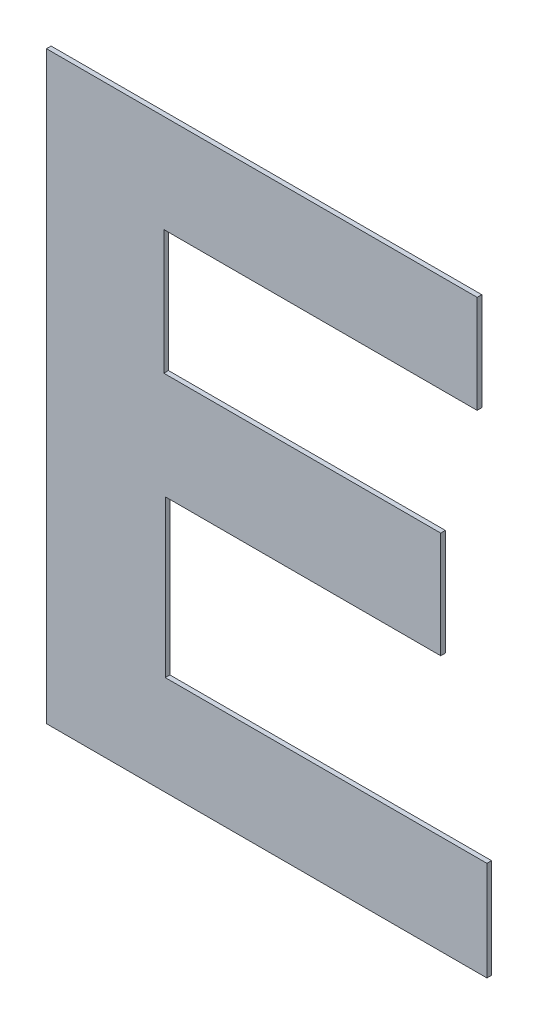
ISO-10303-21;
HEADER;
FILE_DESCRIPTION(('STEP AP214'),'2;1');
FILE_NAME('part.step','',(''),(''),'','','');
FILE_SCHEMA(('AUTOMOTIVE_DESIGN { 1 0 10303 214 1 1 1 1 }'));
ENDSEC;
DATA;
#1=APPLICATION_CONTEXT('core data for automotive mechanical design processes');
#2=APPLICATION_PROTOCOL_DEFINITION('international standard','automotive_design',2000,#1);
#3=PRODUCT_CONTEXT('',#1,'mechanical');
#4=PRODUCT('Part','Part','',(#3));
#5=PRODUCT_RELATED_PRODUCT_CATEGORY('part','',(#4));
#6=PRODUCT_DEFINITION_FORMATION('','',#4);
#7=PRODUCT_DEFINITION_CONTEXT('part definition',#1,'design');
#8=PRODUCT_DEFINITION('design','',#6,#7);
#9=PRODUCT_DEFINITION_SHAPE('','',#8);
#10=(LENGTH_UNIT() NAMED_UNIT(*) SI_UNIT(.MILLI.,.METRE.));
#11=(NAMED_UNIT(*) PLANE_ANGLE_UNIT() SI_UNIT($,.RADIAN.));
#12=(NAMED_UNIT(*) SI_UNIT($,.STERADIAN.) SOLID_ANGLE_UNIT());
#13=UNCERTAINTY_MEASURE_WITH_UNIT(LENGTH_MEASURE(1.E-05),#10,'distance_accuracy_value','');
#14=(GEOMETRIC_REPRESENTATION_CONTEXT(3) GLOBAL_UNCERTAINTY_ASSIGNED_CONTEXT((#13)) GLOBAL_UNIT_ASSIGNED_CONTEXT((#10,
#11,#12)) REPRESENTATION_CONTEXT('',''));
#15=CARTESIAN_POINT('',(0.,0.,0.));
#16=DIRECTION('',(0.,0.,1.));
#17=DIRECTION('',(1.,0.,0.));
#18=AXIS2_PLACEMENT_3D('',#15,#16,#17);
#19=CARTESIAN_POINT('',(-0.7002789706921,-0.078781583834882,0.00086146168299));
#20=DIRECTION('',(-1.,0.,0.));
#21=DIRECTION('',(0.,0.,1.));
#22=AXIS2_PLACEMENT_3D('',#19,#20,#21);
#23=PLANE('',#22);
#24=DIRECTION('',(0.,0.,1.));
#25=VECTOR('',#24,1.);
#26=CARTESIAN_POINT('',(-0.7002789706921,-0.1544312260326,-0.00033853831701));
#27=LINE('',#26,#25);
#28=CARTESIAN_POINT('',(-0.7002789706921,-0.1544312260326,-0.00033853831701));
#29=VERTEX_POINT('',#28);
#30=CARTESIAN_POINT('',(-0.7002789706921,-0.1544312260326,0.00086146168299));
#31=VERTEX_POINT('',#30);
#32=EDGE_CURVE('E11',#29,#31,#27,.T.);
#33=ORIENTED_EDGE('',*,*,#32,.T.);
#34=DIRECTION('',(0.,1.,0.));
#35=VECTOR('',#34,1.);
#36=CARTESIAN_POINT('',(-0.7002789706921,-0.1544312260326,0.00086146168299));
#37=LINE('',#36,#35);
#38=CARTESIAN_POINT('',(-0.7002789706921,-0.00313194163716401,0.00086146168299));
#39=VERTEX_POINT('',#38);
#40=EDGE_CURVE('E24',#31,#39,#37,.T.);
#41=ORIENTED_EDGE('',*,*,#40,.T.);
#42=DIRECTION('',(0.,0.,1.));
#43=VECTOR('',#42,1.);
#44=CARTESIAN_POINT('',(-0.7002789706921,-0.00313194163716401,-0.00033853831701));
#45=LINE('',#44,#43);
#46=CARTESIAN_POINT('',(-0.7002789706921,-0.00313194163716401,-0.00033853831701));
#47=VERTEX_POINT('',#46);
#48=EDGE_CURVE('E197',#47,#39,#45,.T.);
#49=ORIENTED_EDGE('',*,*,#48,.F.);
#50=DIRECTION('',(0.,1.,0.));
#51=VECTOR('',#50,1.);
#52=CARTESIAN_POINT('',(-0.7002789706921,-0.1544312260326,-0.00033853831701));
#53=LINE('',#52,#51);
#54=EDGE_CURVE('E195',#29,#47,#53,.T.);
#55=ORIENTED_EDGE('',*,*,#54,.F.);
#56=EDGE_LOOP('',(#33,#41,#49,#55));
#57=FACE_BOUND('',#56,.T.);
#58=ADVANCED_FACE('F17',(#57),#23,.T.);
#59=CARTESIAN_POINT('',(-0.6445458179521,-0.00313194163716401,0.00086146168299));
#60=DIRECTION('',(0.,1.,0.));
#61=DIRECTION('',(0.,0.,1.));
#62=AXIS2_PLACEMENT_3D('',#59,#60,#61);
#63=PLANE('',#62);
#64=ORIENTED_EDGE('',*,*,#48,.T.);
#65=DIRECTION('',(1.,0.,0.));
#66=VECTOR('',#65,1.);
#67=CARTESIAN_POINT('',(-0.7002789706921,-0.00313194163716401,0.00086146168299));
#68=LINE('',#67,#66);
#69=CARTESIAN_POINT('',(-0.5888126652121,-0.00313194163716401,0.00086146168299));
#70=VERTEX_POINT('',#69);
#71=EDGE_CURVE('E193',#39,#70,#68,.T.);
#72=ORIENTED_EDGE('',*,*,#71,.T.);
#73=DIRECTION('',(0.,0.,1.));
#74=VECTOR('',#73,1.);
#75=CARTESIAN_POINT('',(-0.5888126652121,-0.00313194163716401,-0.00033853831701));
#76=LINE('',#75,#74);
#77=CARTESIAN_POINT('',(-0.5888126652121,-0.00313194163716401,-0.00033853831701));
#78=VERTEX_POINT('',#77);
#79=EDGE_CURVE('E190',#78,#70,#76,.T.);
#80=ORIENTED_EDGE('',*,*,#79,.F.);
#81=DIRECTION('',(1.,0.,0.));
#82=VECTOR('',#81,1.);
#83=CARTESIAN_POINT('',(-0.7002789706921,-0.00313194163716401,-0.00033853831701));
#84=LINE('',#83,#82);
#85=EDGE_CURVE('E187',#47,#78,#84,.T.);
#86=ORIENTED_EDGE('',*,*,#85,.F.);
#87=EDGE_LOOP('',(#64,#72,#80,#86));
#88=FACE_BOUND('',#87,.T.);
#89=ADVANCED_FACE('F203',(#88),#63,.T.);
#90=CARTESIAN_POINT('',(-0.5888126652121,-0.015802228964852,0.00086146168299));
#91=DIRECTION('',(1.,0.,0.));
#92=DIRECTION('',(0.,0.,-1.));
#93=AXIS2_PLACEMENT_3D('',#90,#91,#92);
#94=PLANE('',#93);
#95=ORIENTED_EDGE('',*,*,#79,.T.);
#96=DIRECTION('',(0.,-1.,0.));
#97=VECTOR('',#96,1.);
#98=CARTESIAN_POINT('',(-0.5888126652121,-0.00313194163716401,0.00086146168299));
#99=LINE('',#98,#97);
#100=CARTESIAN_POINT('',(-0.5888126652121,-0.02847251629254,0.00086146168299));
#101=VERTEX_POINT('',#100);
#102=EDGE_CURVE('E185',#70,#101,#99,.T.);
#103=ORIENTED_EDGE('',*,*,#102,.T.);
#104=DIRECTION('',(0.,0.,1.));
#105=VECTOR('',#104,1.);
#106=CARTESIAN_POINT('',(-0.5888126652121,-0.02847251629254,-0.00033853831701));
#107=LINE('',#106,#105);
#108=CARTESIAN_POINT('',(-0.5888126652121,-0.02847251629254,-0.00033853831701));
#109=VERTEX_POINT('',#108);
#110=EDGE_CURVE('E182',#109,#101,#107,.T.);
#111=ORIENTED_EDGE('',*,*,#110,.F.);
#112=DIRECTION('',(0.,-1.,0.));
#113=VECTOR('',#112,1.);
#114=CARTESIAN_POINT('',(-0.5888126652121,-0.00313194163716401,-0.00033853831701));
#115=LINE('',#114,#113);
#116=EDGE_CURVE('E179',#78,#109,#115,.T.);
#117=ORIENTED_EDGE('',*,*,#116,.F.);
#118=EDGE_LOOP('',(#95,#103,#111,#117));
#119=FACE_BOUND('',#118,.T.);
#120=ADVANCED_FACE('F209',(#119),#94,.T.);
#121=CARTESIAN_POINT('',(-0.629355128198574,-0.02847251629254,0.00086146168299));
#122=DIRECTION('',(0.,-1.,0.));
#123=DIRECTION('',(0.,0.,-1.));
#124=AXIS2_PLACEMENT_3D('',#121,#122,#123);
#125=PLANE('',#124);
#126=ORIENTED_EDGE('',*,*,#110,.T.);
#127=DIRECTION('',(-1.,0.,0.));
#128=VECTOR('',#127,1.);
#129=CARTESIAN_POINT('',(-0.5888126652121,-0.02847251629254,0.00086146168299));
#130=LINE('',#129,#128);
#131=CARTESIAN_POINT('',(-0.669897591185048,-0.02847251629254,0.00086146168299));
#132=VERTEX_POINT('',#131);
#133=EDGE_CURVE('E177',#101,#132,#130,.T.);
#134=ORIENTED_EDGE('',*,*,#133,.T.);
#135=DIRECTION('',(0.,0.,1.));
#136=VECTOR('',#135,1.);
#137=CARTESIAN_POINT('',(-0.669897591185048,-0.02847251629254,-0.00033853831701));
#138=LINE('',#137,#136);
#139=CARTESIAN_POINT('',(-0.669897591185048,-0.02847251629254,-0.00033853831701));
#140=VERTEX_POINT('',#139);
#141=EDGE_CURVE('E174',#140,#132,#138,.T.);
#142=ORIENTED_EDGE('',*,*,#141,.F.);
#143=DIRECTION('',(-1.,0.,0.));
#144=VECTOR('',#143,1.);
#145=CARTESIAN_POINT('',(-0.5888126652121,-0.02847251629254,-0.00033853831701));
#146=LINE('',#145,#144);
#147=EDGE_CURVE('E171',#109,#140,#146,.T.);
#148=ORIENTED_EDGE('',*,*,#147,.F.);
#149=EDGE_LOOP('',(#126,#134,#142,#148));
#150=FACE_BOUND('',#149,.T.);
#151=ADVANCED_FACE('F213',(#150),#125,.T.);
#152=CARTESIAN_POINT('',(-0.669897591185048,-0.04457751571217,0.00086146168299));
#153=DIRECTION('',(1.,0.,0.));
#154=DIRECTION('',(0.,0.,-1.));
#155=AXIS2_PLACEMENT_3D('',#152,#153,#154);
#156=PLANE('',#155);
#157=ORIENTED_EDGE('',*,*,#141,.T.);
#158=DIRECTION('',(0.,-1.,0.));
#159=VECTOR('',#158,1.);
#160=CARTESIAN_POINT('',(-0.669897591185048,-0.02847251629254,0.00086146168299));
#161=LINE('',#160,#159);
#162=CARTESIAN_POINT('',(-0.669897591185048,-0.0606825151318,0.00086146168299));
#163=VERTEX_POINT('',#162);
#164=EDGE_CURVE('E169',#132,#163,#161,.T.);
#165=ORIENTED_EDGE('',*,*,#164,.T.);
#166=DIRECTION('',(0.,0.,1.));
#167=VECTOR('',#166,1.);
#168=CARTESIAN_POINT('',(-0.669897591185048,-0.0606825151318,-0.00033853831701));
#169=LINE('',#168,#167);
#170=CARTESIAN_POINT('',(-0.669897591185048,-0.0606825151318,-0.00033853831701));
#171=VERTEX_POINT('',#170);
#172=EDGE_CURVE('E166',#171,#163,#169,.T.);
#173=ORIENTED_EDGE('',*,*,#172,.F.);
#174=DIRECTION('',(0.,-1.,0.));
#175=VECTOR('',#174,1.);
#176=CARTESIAN_POINT('',(-0.669897591185048,-0.02847251629254,-0.00033853831701));
#177=LINE('',#176,#175);
#178=EDGE_CURVE('E163',#140,#171,#177,.T.);
#179=ORIENTED_EDGE('',*,*,#178,.F.);
#180=EDGE_LOOP('',(#157,#165,#173,#179));
#181=FACE_BOUND('',#180,.T.);
#182=ADVANCED_FACE('F217',(#181),#156,.T.);
#183=CARTESIAN_POINT('',(-0.634066839369706,-0.0606825151318,0.00086146168299));
#184=DIRECTION('',(0.,1.,0.));
#185=DIRECTION('',(0.,0.,1.));
#186=AXIS2_PLACEMENT_3D('',#183,#184,#185);
#187=PLANE('',#186);
#188=ORIENTED_EDGE('',*,*,#172,.T.);
#189=DIRECTION('',(1.,0.,0.));
#190=VECTOR('',#189,1.);
#191=CARTESIAN_POINT('',(-0.669897591185048,-0.0606825151318,0.00086146168299));
#192=LINE('',#191,#190);
#193=CARTESIAN_POINT('',(-0.598236087554364,-0.0606825151318,0.00086146168299));
#194=VERTEX_POINT('',#193);
#195=EDGE_CURVE('E161',#163,#194,#192,.T.);
#196=ORIENTED_EDGE('',*,*,#195,.T.);
#197=DIRECTION('',(0.,0.,1.));
#198=VECTOR('',#197,1.);
#199=CARTESIAN_POINT('',(-0.598236087554364,-0.0606825151318,-0.00033853831701));
#200=LINE('',#199,#198);
#201=CARTESIAN_POINT('',(-0.598236087554364,-0.0606825151318,-0.00033853831701));
#202=VERTEX_POINT('',#201);
#203=EDGE_CURVE('E158',#202,#194,#200,.T.);
#204=ORIENTED_EDGE('',*,*,#203,.F.);
#205=DIRECTION('',(1.,0.,0.));
#206=VECTOR('',#205,1.);
#207=CARTESIAN_POINT('',(-0.669897591185048,-0.0606825151318,-0.00033853831701));
#208=LINE('',#207,#206);
#209=EDGE_CURVE('E155',#171,#202,#208,.T.);
#210=ORIENTED_EDGE('',*,*,#209,.F.);
#211=EDGE_LOOP('',(#188,#196,#204,#210));
#212=FACE_BOUND('',#211,.T.);
#213=ADVANCED_FACE('F220',(#212),#187,.T.);
#214=CARTESIAN_POINT('',(-0.598236087554364,-0.0744368970102,0.00086146168299));
#215=DIRECTION('',(1.,0.,0.));
#216=DIRECTION('',(0.,0.,-1.));
#217=AXIS2_PLACEMENT_3D('',#214,#215,#216);
#218=PLANE('',#217);
#219=ORIENTED_EDGE('',*,*,#203,.T.);
#220=DIRECTION('',(0.,-1.,0.));
#221=VECTOR('',#220,1.);
#222=CARTESIAN_POINT('',(-0.598236087554364,-0.0606825151318,0.00086146168299));
#223=LINE('',#222,#221);
#224=CARTESIAN_POINT('',(-0.598236087554364,-0.0881912788886,0.00086146168299));
#225=VERTEX_POINT('',#224);
#226=EDGE_CURVE('E153',#194,#225,#223,.T.);
#227=ORIENTED_EDGE('',*,*,#226,.T.);
#228=DIRECTION('',(0.,0.,1.));
#229=VECTOR('',#228,1.);
#230=CARTESIAN_POINT('',(-0.598236087554364,-0.0881912788886,-0.00033853831701));
#231=LINE('',#230,#229);
#232=CARTESIAN_POINT('',(-0.598236087554364,-0.0881912788886,-0.00033853831701));
#233=VERTEX_POINT('',#232);
#234=EDGE_CURVE('E150',#233,#225,#231,.T.);
#235=ORIENTED_EDGE('',*,*,#234,.F.);
#236=DIRECTION('',(0.,-1.,0.));
#237=VECTOR('',#236,1.);
#238=CARTESIAN_POINT('',(-0.598236087554364,-0.0606825151318,-0.00033853831701));
#239=LINE('',#238,#237);
#240=EDGE_CURVE('E147',#202,#233,#239,.T.);
#241=ORIENTED_EDGE('',*,*,#240,.F.);
#242=EDGE_LOOP('',(#219,#227,#235,#241));
#243=FACE_BOUND('',#242,.T.);
#244=ADVANCED_FACE('F225',(#243),#218,.T.);
#245=CARTESIAN_POINT('',(-0.633883327196516,-0.0881912788886,0.00086146168299));
#246=DIRECTION('',(0.,-1.,0.));
#247=DIRECTION('',(0.,0.,-1.));
#248=AXIS2_PLACEMENT_3D('',#245,#246,#247);
#249=PLANE('',#248);
#250=ORIENTED_EDGE('',*,*,#234,.T.);
#251=DIRECTION('',(-1.,0.,0.));
#252=VECTOR('',#251,1.);
#253=CARTESIAN_POINT('',(-0.598236087554364,-0.0881912788886,0.00086146168299));
#254=LINE('',#253,#252);
#255=CARTESIAN_POINT('',(-0.669530566838668,-0.0881912788886,0.00086146168299));
#256=VERTEX_POINT('',#255);
#257=EDGE_CURVE('E145',#225,#256,#254,.T.);
#258=ORIENTED_EDGE('',*,*,#257,.T.);
#259=DIRECTION('',(0.,0.,1.));
#260=VECTOR('',#259,1.);
#261=CARTESIAN_POINT('',(-0.669530566838668,-0.0881912788886,-0.00033853831701));
#262=LINE('',#261,#260);
#263=CARTESIAN_POINT('',(-0.669530566838668,-0.0881912788886,-0.00033853831701));
#264=VERTEX_POINT('',#263);
#265=EDGE_CURVE('E142',#264,#256,#262,.T.);
#266=ORIENTED_EDGE('',*,*,#265,.F.);
#267=DIRECTION('',(-1.,0.,0.));
#268=VECTOR('',#267,1.);
#269=CARTESIAN_POINT('',(-0.598236087554364,-0.0881912788886,-0.00033853831701));
#270=LINE('',#269,#268);
#271=EDGE_CURVE('E139',#233,#264,#270,.T.);
#272=ORIENTED_EDGE('',*,*,#271,.F.);
#273=EDGE_LOOP('',(#250,#258,#266,#272));
#274=FACE_BOUND('',#273,.T.);
#275=ADVANCED_FACE('F229',(#274),#249,.T.);
#276=CARTESIAN_POINT('',(-0.669530566838668,-0.1084588979374,0.00086146168299));
#277=DIRECTION('',(1.,0.,0.));
#278=DIRECTION('',(0.,0.,-1.));
#279=AXIS2_PLACEMENT_3D('',#276,#277,#278);
#280=PLANE('',#279);
#281=ORIENTED_EDGE('',*,*,#265,.T.);
#282=DIRECTION('',(0.,-1.,0.));
#283=VECTOR('',#282,1.);
#284=CARTESIAN_POINT('',(-0.669530566838668,-0.0881912788886,0.00086146168299));
#285=LINE('',#284,#283);
#286=CARTESIAN_POINT('',(-0.669530566838668,-0.1287265169862,0.00086146168299));
#287=VERTEX_POINT('',#286);
#288=EDGE_CURVE('E137',#256,#287,#285,.T.);
#289=ORIENTED_EDGE('',*,*,#288,.T.);
#290=DIRECTION('',(0.,0.,1.));
#291=VECTOR('',#290,1.);
#292=CARTESIAN_POINT('',(-0.669530566838668,-0.1287265169862,-0.00033853831701));
#293=LINE('',#292,#291);
#294=CARTESIAN_POINT('',(-0.669530566838668,-0.1287265169862,-0.00033853831701));
#295=VERTEX_POINT('',#294);
#296=EDGE_CURVE('E134',#295,#287,#293,.T.);
#297=ORIENTED_EDGE('',*,*,#296,.F.);
#298=DIRECTION('',(0.,-1.,0.));
#299=VECTOR('',#298,1.);
#300=CARTESIAN_POINT('',(-0.669530566838668,-0.0881912788886,-0.00033853831701));
#301=LINE('',#300,#299);
#302=EDGE_CURVE('E132',#264,#295,#301,.T.);
#303=ORIENTED_EDGE('',*,*,#302,.F.);
#304=EDGE_LOOP('',(#281,#289,#297,#303));
#305=FACE_BOUND('',#304,.T.);
#306=ADVANCED_FACE('F232',(#305),#280,.T.);
#307=CARTESIAN_POINT('',(-0.627904370545984,-0.1287265169862,0.00086146168299));
#308=DIRECTION('',(0.,1.,0.));
#309=DIRECTION('',(0.,0.,1.));
#310=AXIS2_PLACEMENT_3D('',#307,#308,#309);
#311=PLANE('',#310);
#312=ORIENTED_EDGE('',*,*,#296,.T.);
#313=DIRECTION('',(1.,0.,0.));
#314=VECTOR('',#313,1.);
#315=CARTESIAN_POINT('',(-0.669530566838668,-0.1287265169862,0.00086146168299));
#316=LINE('',#315,#314);
#317=CARTESIAN_POINT('',(-0.5862781742533,-0.1287265169862,0.00086146168299));
#318=VERTEX_POINT('',#317);
#319=EDGE_CURVE('E130',#287,#318,#316,.T.);
#320=ORIENTED_EDGE('',*,*,#319,.T.);
#321=DIRECTION('',(0.,0.,1.));
#322=VECTOR('',#321,1.);
#323=CARTESIAN_POINT('',(-0.5862781742533,-0.1287265169862,-0.00033853831701));
#324=LINE('',#323,#322);
#325=CARTESIAN_POINT('',(-0.5862781742533,-0.1287265169862,-0.00033853831701));
#326=VERTEX_POINT('',#325);
#327=EDGE_CURVE('E128',#326,#318,#324,.T.);
#328=ORIENTED_EDGE('',*,*,#327,.F.);
#329=DIRECTION('',(1.,0.,0.));
#330=VECTOR('',#329,1.);
#331=CARTESIAN_POINT('',(-0.669530566838668,-0.1287265169862,-0.00033853831701));
#332=LINE('',#331,#330);
#333=EDGE_CURVE('E119',#295,#326,#332,.T.);
#334=ORIENTED_EDGE('',*,*,#333,.F.);
#335=EDGE_LOOP('',(#312,#320,#328,#334));
#336=FACE_BOUND('',#335,.T.);
#337=ADVANCED_FACE('F235',(#336),#311,.T.);
#338=CARTESIAN_POINT('',(-0.5862781742533,-0.1415788715094,0.00086146168299));
#339=DIRECTION('',(1.,0.,0.));
#340=DIRECTION('',(0.,0.,-1.));
#341=AXIS2_PLACEMENT_3D('',#338,#339,#340);
#342=PLANE('',#341);
#343=ORIENTED_EDGE('',*,*,#327,.T.);
#344=DIRECTION('',(0.,-1.,0.));
#345=VECTOR('',#344,1.);
#346=CARTESIAN_POINT('',(-0.5862781742533,-0.1287265169862,0.00086146168299));
#347=LINE('',#346,#345);
#348=CARTESIAN_POINT('',(-0.5862781742533,-0.1544312260326,0.00086146168299));
#349=VERTEX_POINT('',#348);
#350=EDGE_CURVE('E108',#318,#349,#347,.T.);
#351=ORIENTED_EDGE('',*,*,#350,.T.);
#352=DIRECTION('',(0.,0.,1.));
#353=VECTOR('',#352,1.);
#354=CARTESIAN_POINT('',(-0.5862781742533,-0.1544312260326,-0.00033853831701));
#355=LINE('',#354,#353);
#356=CARTESIAN_POINT('',(-0.5862781742533,-0.1544312260326,-0.00033853831701));
#357=VERTEX_POINT('',#356);
#358=EDGE_CURVE('E102',#357,#349,#355,.T.);
#359=ORIENTED_EDGE('',*,*,#358,.F.);
#360=DIRECTION('',(0.,-1.,0.));
#361=VECTOR('',#360,1.);
#362=CARTESIAN_POINT('',(-0.5862781742533,-0.1287265169862,-0.00033853831701));
#363=LINE('',#362,#361);
#364=EDGE_CURVE('E106',#326,#357,#363,.T.);
#365=ORIENTED_EDGE('',*,*,#364,.F.);
#366=EDGE_LOOP('',(#343,#351,#359,#365));
#367=FACE_BOUND('',#366,.T.);
#368=ADVANCED_FACE('F105',(#367),#342,.T.);
#369=CARTESIAN_POINT('',(-0.6432785724727,-0.1544312260326,0.00086146168299));
#370=DIRECTION('',(0.,-1.,0.));
#371=DIRECTION('',(0.,0.,-1.));
#372=AXIS2_PLACEMENT_3D('',#369,#370,#371);
#373=PLANE('',#372);
#374=ORIENTED_EDGE('',*,*,#358,.T.);
#375=DIRECTION('',(-1.,0.,0.));
#376=VECTOR('',#375,1.);
#377=CARTESIAN_POINT('',(-0.5862781742533,-0.1544312260326,0.00086146168299));
#378=LINE('',#377,#376);
#379=EDGE_CURVE('E120',#349,#31,#378,.T.);
#380=ORIENTED_EDGE('',*,*,#379,.T.);
#381=ORIENTED_EDGE('',*,*,#32,.F.);
#382=DIRECTION('',(-1.,0.,0.));
#383=VECTOR('',#382,1.);
#384=CARTESIAN_POINT('',(-0.5862781742533,-0.1544312260326,-0.00033853831701));
#385=LINE('',#384,#383);
#386=EDGE_CURVE('E116',#357,#29,#385,.T.);
#387=ORIENTED_EDGE('',*,*,#386,.F.);
#388=EDGE_LOOP('',(#374,#380,#381,#387));
#389=FACE_BOUND('',#388,.T.);
#390=ADVANCED_FACE('F122',(#389),#373,.T.);
#391=CARTESIAN_POINT('',(-0.6432785724727,-0.1544312260326,-0.00033853831701));
#392=DIRECTION('',(0.,0.,1.));
#393=DIRECTION('',(1.,0.,0.));
#394=AXIS2_PLACEMENT_3D('',#391,#392,#393);
#395=PLANE('',#394);
#396=ORIENTED_EDGE('',*,*,#54,.T.);
#397=ORIENTED_EDGE('',*,*,#85,.T.);
#398=ORIENTED_EDGE('',*,*,#116,.T.);
#399=ORIENTED_EDGE('',*,*,#147,.T.);
#400=ORIENTED_EDGE('',*,*,#178,.T.);
#401=ORIENTED_EDGE('',*,*,#209,.T.);
#402=ORIENTED_EDGE('',*,*,#240,.T.);
#403=ORIENTED_EDGE('',*,*,#271,.T.);
#404=ORIENTED_EDGE('',*,*,#302,.T.);
#405=ORIENTED_EDGE('',*,*,#333,.T.);
#406=ORIENTED_EDGE('',*,*,#364,.T.);
#407=ORIENTED_EDGE('',*,*,#386,.T.);
#408=EDGE_LOOP('',(#396,#397,#398,#399,#400,#401,#402,#403,#404,#405,#406,#407));
#409=FACE_BOUND('',#408,.T.);
#410=ADVANCED_FACE('F115',(#409),#395,.F.);
#411=CARTESIAN_POINT('',(-0.6432785724727,-0.1544312260326,0.00086146168299));
#412=DIRECTION('',(0.,0.,1.));
#413=DIRECTION('',(1.,0.,0.));
#414=AXIS2_PLACEMENT_3D('',#411,#412,#413);
#415=PLANE('',#414);
#416=ORIENTED_EDGE('',*,*,#40,.F.);
#417=ORIENTED_EDGE('',*,*,#379,.F.);
#418=ORIENTED_EDGE('',*,*,#350,.F.);
#419=ORIENTED_EDGE('',*,*,#319,.F.);
#420=ORIENTED_EDGE('',*,*,#288,.F.);
#421=ORIENTED_EDGE('',*,*,#257,.F.);
#422=ORIENTED_EDGE('',*,*,#226,.F.);
#423=ORIENTED_EDGE('',*,*,#195,.F.);
#424=ORIENTED_EDGE('',*,*,#164,.F.);
#425=ORIENTED_EDGE('',*,*,#133,.F.);
#426=ORIENTED_EDGE('',*,*,#102,.F.);
#427=ORIENTED_EDGE('',*,*,#71,.F.);
#428=EDGE_LOOP('',(#416,#417,#418,#419,#420,#421,#422,#423,#424,#425,#426,#427));
#429=FACE_BOUND('',#428,.T.);
#430=ADVANCED_FACE('F205',(#429),#415,.T.);
#431=CLOSED_SHELL('',(#58,#89,#120,#151,#182,#213,#244,#275,#306,#337,#368,#390,#410,#430));
#432=MANIFOLD_SOLID_BREP('B1',#431);
#433=ADVANCED_BREP_SHAPE_REPRESENTATION('',(#18,#432),#14);
#434=SHAPE_DEFINITION_REPRESENTATION(#9,#433);
ENDSEC;
END-ISO-10303-21;
